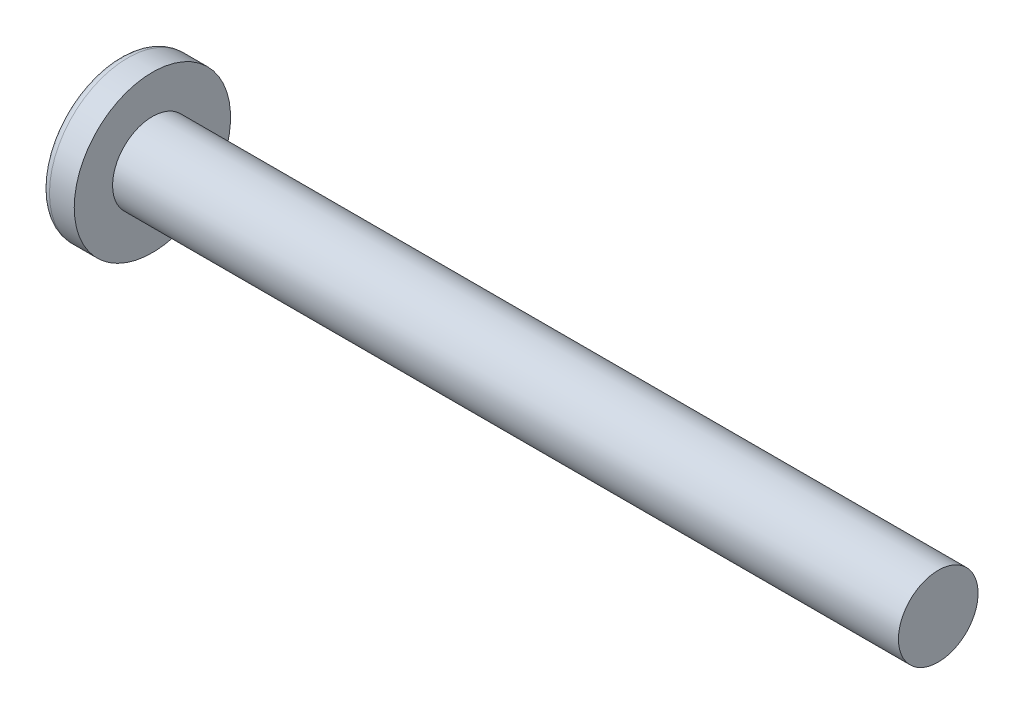
ISO-10303-21;
HEADER;
FILE_DESCRIPTION(('STEP AP214'),'2;1');
FILE_NAME('part.step','',(''),(''),'','','');
FILE_SCHEMA(('AUTOMOTIVE_DESIGN { 1 0 10303 214 1 1 1 1 }'));
ENDSEC;
DATA;
#1=APPLICATION_CONTEXT('core data for automotive mechanical design processes');
#2=APPLICATION_PROTOCOL_DEFINITION('international standard','automotive_design',2000,#1);
#3=PRODUCT_CONTEXT('',#1,'mechanical');
#4=PRODUCT('Part','Part','',(#3));
#5=PRODUCT_RELATED_PRODUCT_CATEGORY('part','',(#4));
#6=PRODUCT_DEFINITION_FORMATION('','',#4);
#7=PRODUCT_DEFINITION_CONTEXT('part definition',#1,'design');
#8=PRODUCT_DEFINITION('design','',#6,#7);
#9=PRODUCT_DEFINITION_SHAPE('','',#8);
#10=(LENGTH_UNIT() NAMED_UNIT(*) SI_UNIT(.MILLI.,.METRE.));
#11=(NAMED_UNIT(*) PLANE_ANGLE_UNIT() SI_UNIT($,.RADIAN.));
#12=(NAMED_UNIT(*) SI_UNIT($,.STERADIAN.) SOLID_ANGLE_UNIT());
#13=UNCERTAINTY_MEASURE_WITH_UNIT(LENGTH_MEASURE(1.E-05),#10,'distance_accuracy_value','');
#14=(GEOMETRIC_REPRESENTATION_CONTEXT(3) GLOBAL_UNCERTAINTY_ASSIGNED_CONTEXT((#13)) GLOBAL_UNIT_ASSIGNED_CONTEXT((#10,
#11,#12)) REPRESENTATION_CONTEXT('',''));
#15=CARTESIAN_POINT('',(0.,0.,0.));
#16=DIRECTION('',(0.,0.,1.));
#17=DIRECTION('',(1.,0.,0.));
#18=AXIS2_PLACEMENT_3D('',#15,#16,#17);
#19=CARTESIAN_POINT('',(7.7216,0.,0.));
#20=DIRECTION('',(-1.,0.,0.));
#21=DIRECTION('',(0.,1.,0.));
#22=AXIS2_PLACEMENT_3D('',#19,#20,#21);
#23=SPHERICAL_SURFACE('',#22,7.7216);
#24=CARTESIAN_POINT('',(1.46619704189251,0.,0.));
#25=DIRECTION('',(-1.,0.,0.));
#26=DIRECTION('',(0.,0.,1.));
#27=AXIS2_PLACEMENT_3D('',#24,#25,#26);
#28=CIRCLE('',#27,4.52692394366197);
#29=CARTESIAN_POINT('',(1.46619704189251,0.,4.52692394366197));
#30=VERTEX_POINT('',#29);
#31=EDGE_CURVE('E151',#30,#30,#28,.T.);
#32=ORIENTED_EDGE('',*,*,#31,.T.);
#33=EDGE_LOOP('',(#32));
#34=FACE_BOUND('',#33,.T.);
#35=CARTESIAN_POINT('',(7.71626836849415,-0.0635159579392897,0.));
#36=DIRECTION('',(-0.0836474251843073,-0.996495413065226,0.));
#37=DIRECTION('',(0.996495413065226,-0.0836474251843073,0.));
#38=AXIS2_PLACEMENT_3D('',#35,#36,#37);
#39=CIRCLE('',#38,7.72133692159541);
#40=CARTESIAN_POINT('',(0.492297297865043,0.542875774266794,2.65811491373462));
#41=VERTEX_POINT('',#40);
#42=CARTESIAN_POINT('',(0.0437691983649017,0.580525943202944,0.580525943202946));
#43=VERTEX_POINT('',#42);
#44=EDGE_CURVE('E182',#41,#43,#39,.T.);
#45=ORIENTED_EDGE('',*,*,#44,.F.);
#46=CARTESIAN_POINT('',(6.22874657717022,0.,-1.88498542790488));
#47=DIRECTION('',(0.620849497837049,0.,0.783929780679038));
#48=DIRECTION('',(0.783929780679038,0.,-0.620849497837049));
#49=AXIS2_PLACEMENT_3D('',#46,#47,#48);
#50=CIRCLE('',#49,7.33766482980326);
#51=CARTESIAN_POINT('',(0.492297297865043,-0.542875774266813,2.65811491373462));
#52=VERTEX_POINT('',#51);
#53=EDGE_CURVE('E147',#41,#52,#50,.T.);
#54=ORIENTED_EDGE('',*,*,#53,.T.);
#55=CARTESIAN_POINT('',(7.71626836849415,0.0635159579392895,0.));
#56=DIRECTION('',(-0.0836474251843072,0.996495413065226,0.));
#57=DIRECTION('',(-0.996495413065226,-0.0836474251843073,0.));
#58=AXIS2_PLACEMENT_3D('',#55,#56,#57);
#59=CIRCLE('',#58,7.72133692159541);
#60=CARTESIAN_POINT('',(0.0437691983649017,-0.580525943202948,0.580525943202946));
#61=VERTEX_POINT('',#60);
#62=EDGE_CURVE('E103',#61,#52,#59,.T.);
#63=ORIENTED_EDGE('',*,*,#62,.F.);
#64=CARTESIAN_POINT('',(7.71626836849415,0.,-0.0635159579392895));
#65=DIRECTION('',(-0.0836474251843072,0.,-0.996495413065226));
#66=DIRECTION('',(-0.996495413065226,0.,0.0836474251843073));
#67=AXIS2_PLACEMENT_3D('',#64,#65,#66);
#68=CIRCLE('',#67,7.72133692159541);
#69=CARTESIAN_POINT('',(0.492297297865042,-2.65811491373462,0.542875774266803));
#70=VERTEX_POINT('',#69);
#71=EDGE_CURVE('E128',#70,#61,#68,.T.);
#72=ORIENTED_EDGE('',*,*,#71,.F.);
#73=CARTESIAN_POINT('',(6.22874657717022,1.88498542790488,0.));
#74=DIRECTION('',(0.620849497837048,-0.783929780679038,0.));
#75=DIRECTION('',(0.783929780679038,0.620849497837048,0.));
#76=AXIS2_PLACEMENT_3D('',#73,#74,#75);
#77=CIRCLE('',#76,7.33766482980326);
#78=CARTESIAN_POINT('',(0.492297297865042,-2.65811491373462,-0.542875774266803));
#79=VERTEX_POINT('',#78);
#80=EDGE_CURVE('E136',#70,#79,#77,.T.);
#81=ORIENTED_EDGE('',*,*,#80,.T.);
#82=CARTESIAN_POINT('',(7.71626836849415,0.,0.0635159579392897));
#83=DIRECTION('',(-0.0836474251843073,0.,0.996495413065226));
#84=DIRECTION('',(0.996495413065226,0.,0.0836474251843073));
#85=AXIS2_PLACEMENT_3D('',#82,#83,#84);
#86=CIRCLE('',#85,7.72133692159541);
#87=CARTESIAN_POINT('',(0.0437691983649017,-0.580525943202944,-0.580525943202946));
#88=VERTEX_POINT('',#87);
#89=EDGE_CURVE('E46',#88,#79,#86,.T.);
#90=ORIENTED_EDGE('',*,*,#89,.F.);
#91=CARTESIAN_POINT('',(0.492297297865041,-0.542875774266793,-2.65811491373462));
#92=VERTEX_POINT('',#91);
#93=EDGE_CURVE('E189',#92,#88,#59,.T.);
#94=ORIENTED_EDGE('',*,*,#93,.F.);
#95=CARTESIAN_POINT('',(6.22874657717022,0.,1.88498542790488));
#96=DIRECTION('',(0.620849497837048,0.,-0.783929780679038));
#97=DIRECTION('',(-0.783929780679038,0.,-0.620849497837048));
#98=AXIS2_PLACEMENT_3D('',#95,#96,#97);
#99=CIRCLE('',#98,7.33766482980326);
#100=CARTESIAN_POINT('',(0.492297297865041,0.542875774266812,-2.65811491373462));
#101=VERTEX_POINT('',#100);
#102=EDGE_CURVE('E129',#92,#101,#99,.T.);
#103=ORIENTED_EDGE('',*,*,#102,.T.);
#104=CARTESIAN_POINT('',(0.0437691983649017,0.580525943202948,-0.580525943202946));
#105=VERTEX_POINT('',#104);
#106=EDGE_CURVE('E177',#105,#101,#39,.T.);
#107=ORIENTED_EDGE('',*,*,#106,.F.);
#108=CARTESIAN_POINT('',(0.492297297865042,2.65811491373462,-0.542875774266803));
#109=VERTEX_POINT('',#108);
#110=EDGE_CURVE('E39',#109,#105,#86,.T.);
#111=ORIENTED_EDGE('',*,*,#110,.F.);
#112=CARTESIAN_POINT('',(6.22874657717022,-1.88498542790488,0.));
#113=DIRECTION('',(0.620849497837049,0.783929780679038,0.));
#114=DIRECTION('',(-0.783929780679038,0.620849497837049,0.));
#115=AXIS2_PLACEMENT_3D('',#112,#113,#114);
#116=CIRCLE('',#115,7.33766482980326);
#117=CARTESIAN_POINT('',(0.492297297865043,2.65811491373462,0.542875774266803));
#118=VERTEX_POINT('',#117);
#119=EDGE_CURVE('E11',#109,#118,#116,.T.);
#120=ORIENTED_EDGE('',*,*,#119,.T.);
#121=EDGE_CURVE('E165',#43,#118,#68,.T.);
#122=ORIENTED_EDGE('',*,*,#121,.F.);
#123=EDGE_LOOP('',(#45,#54,#63,#72,#81,#90,#94,#103,#107,#111,#120,#122));
#124=FACE_BOUND('',#123,.T.);
#125=ADVANCED_FACE('F31',(#34,#124),#23,.T.);
#126=CARTESIAN_POINT('',(3.8486267281106,0.,-0.261140092165899));
#127=DIRECTION('',(-0.0836474251843073,0.,0.996495413065226));
#128=DIRECTION('',(0.996495413065226,0.,0.0836474251843073));
#129=AXIS2_PLACEMENT_3D('',#126,#127,#128);
#130=PLANE('',#129);
#131=ORIENTED_EDGE('',*,*,#110,.T.);
#132=DIRECTION('',(0.993027416127926,-0.0833563159523445,0.0833563159523442));
#133=VECTOR('',#132,1.);
#134=CARTESIAN_POINT('',(3.87024262719418,0.259325618885161,-0.25932561888516));
#135=LINE('',#134,#133);
#136=CARTESIAN_POINT('',(3.4798,0.292100000000001,-0.292099999999999));
#137=VERTEX_POINT('',#136);
#138=EDGE_CURVE('E171',#105,#137,#135,.T.);
#139=ORIENTED_EDGE('',*,*,#138,.T.);
#140=DIRECTION('',(0.782237983126563,-0.619509643571037,0.0656623124522297));
#141=VECTOR('',#140,1.);
#142=CARTESIAN_POINT('',(0.,3.048,-0.5842));
#143=LINE('',#142,#141);
#144=EDGE_CURVE('E152',#109,#137,#143,.T.);
#145=ORIENTED_EDGE('',*,*,#144,.F.);
#146=EDGE_LOOP('',(#131,#139,#145));
#147=FACE_BOUND('',#146,.T.);
#148=ADVANCED_FACE('F170',(#147),#130,.T.);
#149=DIRECTION('',(0.782237983126563,0.619509643571037,0.0656623124522297));
#150=VECTOR('',#149,1.);
#151=CARTESIAN_POINT('',(0.,-3.048,-0.5842));
#152=LINE('',#151,#150);
#153=CARTESIAN_POINT('',(3.4798,-0.2921,-0.2921));
#154=VERTEX_POINT('',#153);
#155=EDGE_CURVE('E137',#79,#154,#152,.T.);
#156=ORIENTED_EDGE('',*,*,#155,.T.);
#157=DIRECTION('',(-0.993027416127926,-0.0833563159523438,-0.0833563159523442));
#158=VECTOR('',#157,1.);
#159=CARTESIAN_POINT('',(3.87024262719418,-0.259325618885159,-0.25932561888516));
#160=LINE('',#159,#158);
#161=EDGE_CURVE('E192',#154,#88,#160,.T.);
#162=ORIENTED_EDGE('',*,*,#161,.T.);
#163=ORIENTED_EDGE('',*,*,#89,.T.);
#164=EDGE_LOOP('',(#156,#162,#163));
#165=FACE_BOUND('',#164,.T.);
#166=ADVANCED_FACE('F207',(#165),#130,.T.);
#167=CARTESIAN_POINT('',(3.8486267281106,0.,0.261140092165899));
#168=DIRECTION('',(-0.0836474251843072,0.,-0.996495413065226));
#169=DIRECTION('',(-0.996495413065226,0.,0.0836474251843073));
#170=AXIS2_PLACEMENT_3D('',#167,#168,#169);
#171=PLANE('',#170);
#172=DIRECTION('',(0.782237983126563,-0.619509643571037,-0.0656623124522298));
#173=VECTOR('',#172,1.);
#174=CARTESIAN_POINT('',(0.,3.048,0.5842));
#175=LINE('',#174,#173);
#176=CARTESIAN_POINT('',(3.4798,0.2921,0.2921));
#177=VERTEX_POINT('',#176);
#178=EDGE_CURVE('E208',#118,#177,#175,.T.);
#179=ORIENTED_EDGE('',*,*,#178,.T.);
#180=DIRECTION('',(-0.993027416127926,0.0833563159523439,0.0833563159523442));
#181=VECTOR('',#180,1.);
#182=CARTESIAN_POINT('',(3.87024262719418,0.259325618885159,0.25932561888516));
#183=LINE('',#182,#181);
#184=EDGE_CURVE('E186',#177,#43,#183,.T.);
#185=ORIENTED_EDGE('',*,*,#184,.T.);
#186=ORIENTED_EDGE('',*,*,#121,.T.);
#187=EDGE_LOOP('',(#179,#185,#186));
#188=FACE_BOUND('',#187,.T.);
#189=ADVANCED_FACE('F212',(#188),#171,.T.);
#190=ORIENTED_EDGE('',*,*,#71,.T.);
#191=DIRECTION('',(0.993027416127926,0.0833563159523445,-0.0833563159523441));
#192=VECTOR('',#191,1.);
#193=CARTESIAN_POINT('',(3.87024262719418,-0.259325618885161,0.25932561888516));
#194=LINE('',#193,#192);
#195=CARTESIAN_POINT('',(3.4798,-0.292100000000001,0.292099999999999));
#196=VERTEX_POINT('',#195);
#197=EDGE_CURVE('E101',#61,#196,#194,.T.);
#198=ORIENTED_EDGE('',*,*,#197,.T.);
#199=DIRECTION('',(0.782237983126563,0.619509643571037,-0.0656623124522296));
#200=VECTOR('',#199,1.);
#201=CARTESIAN_POINT('',(0.,-3.048,0.584199999999999));
#202=LINE('',#201,#200);
#203=EDGE_CURVE('E126',#70,#196,#202,.T.);
#204=ORIENTED_EDGE('',*,*,#203,.F.);
#205=EDGE_LOOP('',(#190,#198,#204));
#206=FACE_BOUND('',#205,.T.);
#207=ADVANCED_FACE('F125',(#206),#171,.T.);
#208=CARTESIAN_POINT('',(-25.4,0.,0.));
#209=DIRECTION('',(-1.,0.,0.));
#210=DIRECTION('',(0.,0.,1.));
#211=AXIS2_PLACEMENT_3D('',#208,#209,#210);
#212=CYLINDRICAL_SURFACE('',#211,2.413);
#213=CARTESIAN_POINT('',(51.0032,0.,0.));
#214=DIRECTION('',(-1.,0.,0.));
#215=DIRECTION('',(0.,0.,1.));
#216=AXIS2_PLACEMENT_3D('',#213,#214,#215);
#217=CIRCLE('',#216,2.413);
#218=CARTESIAN_POINT('',(51.0032,0.,2.413));
#219=VERTEX_POINT('',#218);
#220=EDGE_CURVE('E148',#219,#219,#217,.T.);
#221=ORIENTED_EDGE('',*,*,#220,.T.);
#222=EDGE_LOOP('',(#221));
#223=FACE_BOUND('',#222,.T.);
#224=CARTESIAN_POINT('',(3.3782,0.,0.));
#225=DIRECTION('',(-1.,0.,0.));
#226=DIRECTION('',(0.,0.,1.));
#227=AXIS2_PLACEMENT_3D('',#224,#225,#226);
#228=CIRCLE('',#227,2.413);
#229=CARTESIAN_POINT('',(3.3782,0.,2.413));
#230=VERTEX_POINT('',#229);
#231=EDGE_CURVE('E161',#230,#230,#228,.T.);
#232=ORIENTED_EDGE('',*,*,#231,.F.);
#233=EDGE_LOOP('',(#232));
#234=FACE_BOUND('',#233,.T.);
#235=ADVANCED_FACE('F33',(#223,#234),#212,.T.);
#236=CARTESIAN_POINT('',(3.3782,2.413,0.));
#237=DIRECTION('',(-1.,0.,0.));
#238=DIRECTION('',(0.,0.,1.));
#239=AXIS2_PLACEMENT_3D('',#236,#237,#238);
#240=PLANE('',#239);
#241=CARTESIAN_POINT('',(3.3782,0.,0.));
#242=DIRECTION('',(-1.,0.,0.));
#243=DIRECTION('',(0.,0.,1.));
#244=AXIS2_PLACEMENT_3D('',#241,#242,#243);
#245=CIRCLE('',#244,4.7371);
#246=CARTESIAN_POINT('',(3.3782,0.,4.7371));
#247=VERTEX_POINT('',#246);
#248=EDGE_CURVE('E158',#247,#247,#245,.T.);
#249=ORIENTED_EDGE('',*,*,#248,.F.);
#250=EDGE_LOOP('',(#249));
#251=FACE_BOUND('',#250,.T.);
#252=ORIENTED_EDGE('',*,*,#231,.T.);
#253=EDGE_LOOP('',(#252));
#254=FACE_BOUND('',#253,.T.);
#255=ADVANCED_FACE('F240',(#251,#254),#240,.F.);
#256=CARTESIAN_POINT('',(-25.4,0.,0.));
#257=DIRECTION('',(-1.,0.,0.));
#258=DIRECTION('',(0.,0.,1.));
#259=AXIS2_PLACEMENT_3D('',#256,#257,#258);
#260=CYLINDRICAL_SURFACE('',#259,4.7371);
#261=ORIENTED_EDGE('',*,*,#248,.T.);
#262=EDGE_LOOP('',(#261));
#263=FACE_BOUND('',#262,.T.);
#264=CARTESIAN_POINT('',(1.87773671018905,0.,0.));
#265=DIRECTION('',(-1.,0.,0.));
#266=DIRECTION('',(0.,0.,1.));
#267=AXIS2_PLACEMENT_3D('',#264,#265,#266);
#268=CIRCLE('',#267,4.7371);
#269=CARTESIAN_POINT('',(1.87773671018905,0.,4.7371));
#270=VERTEX_POINT('',#269);
#271=EDGE_CURVE('E155',#270,#270,#268,.T.);
#272=ORIENTED_EDGE('',*,*,#271,.F.);
#273=EDGE_LOOP('',(#272));
#274=FACE_BOUND('',#273,.T.);
#275=ADVANCED_FACE('F237',(#263,#274),#260,.T.);
#276=CARTESIAN_POINT('',(1.87773671018906,0.,0.));
#277=DIRECTION('',(-1.,0.,0.));
#278=DIRECTION('',(0.,0.,1.));
#279=AXIS2_PLACEMENT_3D('',#276,#277,#278);
#280=TOROIDAL_SURFACE('',#279,4.2291,0.508);
#281=ORIENTED_EDGE('',*,*,#271,.T.);
#282=EDGE_LOOP('',(#281));
#283=FACE_BOUND('',#282,.T.);
#284=ORIENTED_EDGE('',*,*,#31,.F.);
#285=EDGE_LOOP('',(#284));
#286=FACE_BOUND('',#285,.T.);
#287=ADVANCED_FACE('F234',(#283,#286),#280,.T.);
#288=CARTESIAN_POINT('',(51.0032,2.413,0.));
#289=DIRECTION('',(1.,0.,0.));
#290=DIRECTION('',(0.,0.,-1.));
#291=AXIS2_PLACEMENT_3D('',#288,#289,#290);
#292=PLANE('',#291);
#293=ORIENTED_EDGE('',*,*,#220,.F.);
#294=EDGE_LOOP('',(#293));
#295=FACE_BOUND('',#294,.T.);
#296=ADVANCED_FACE('F232',(#295),#292,.T.);
#297=CARTESIAN_POINT('',(0.,3.048,0.5842));
#298=DIRECTION('',(0.620849497837049,0.783929780679038,0.));
#299=DIRECTION('',(-0.783929780679038,0.620849497837049,0.));
#300=AXIS2_PLACEMENT_3D('',#297,#298,#299);
#301=PLANE('',#300);
#302=ORIENTED_EDGE('',*,*,#144,.T.);
#303=DIRECTION('',(0.,0.,-1.));
#304=VECTOR('',#303,1.);
#305=CARTESIAN_POINT('',(3.4798,0.2921,0.2921));
#306=LINE('',#305,#304);
#307=EDGE_CURVE('E119',#177,#137,#306,.T.);
#308=ORIENTED_EDGE('',*,*,#307,.F.);
#309=ORIENTED_EDGE('',*,*,#178,.F.);
#310=ORIENTED_EDGE('',*,*,#119,.F.);
#311=EDGE_LOOP('',(#302,#308,#309,#310));
#312=FACE_BOUND('',#311,.T.);
#313=ADVANCED_FACE('F211',(#312),#301,.F.);
#314=CARTESIAN_POINT('',(3.4798,-0.2921,-0.2921));
#315=DIRECTION('',(0.620849497837048,-0.783929780679038,0.));
#316=DIRECTION('',(0.783929780679038,0.620849497837048,0.));
#317=AXIS2_PLACEMENT_3D('',#314,#315,#316);
#318=PLANE('',#317);
#319=ORIENTED_EDGE('',*,*,#203,.T.);
#320=DIRECTION('',(0.,0.,1.));
#321=VECTOR('',#320,1.);
#322=CARTESIAN_POINT('',(3.4798,-0.2921,-0.2921));
#323=LINE('',#322,#321);
#324=EDGE_CURVE('E118',#154,#196,#323,.T.);
#325=ORIENTED_EDGE('',*,*,#324,.F.);
#326=ORIENTED_EDGE('',*,*,#155,.F.);
#327=ORIENTED_EDGE('',*,*,#80,.F.);
#328=EDGE_LOOP('',(#319,#325,#326,#327));
#329=FACE_BOUND('',#328,.T.);
#330=ADVANCED_FACE('F133',(#329),#318,.F.);
#331=CARTESIAN_POINT('',(3.4798,0.2921,-0.2921));
#332=DIRECTION('',(-1.,0.,0.));
#333=DIRECTION('',(0.,0.,1.));
#334=AXIS2_PLACEMENT_3D('',#331,#332,#333);
#335=PLANE('',#334);
#336=DIRECTION('',(0.,1.,0.));
#337=VECTOR('',#336,1.);
#338=CARTESIAN_POINT('',(3.4798,-0.2921,-0.2921));
#339=LINE('',#338,#337);
#340=EDGE_CURVE('E141',#154,#137,#339,.T.);
#341=ORIENTED_EDGE('',*,*,#340,.F.);
#342=ORIENTED_EDGE('',*,*,#324,.T.);
#343=DIRECTION('',(0.,-1.,0.));
#344=VECTOR('',#343,1.);
#345=CARTESIAN_POINT('',(3.4798,0.2921,0.2921));
#346=LINE('',#345,#344);
#347=EDGE_CURVE('E110',#177,#196,#346,.T.);
#348=ORIENTED_EDGE('',*,*,#347,.F.);
#349=ORIENTED_EDGE('',*,*,#307,.T.);
#350=EDGE_LOOP('',(#341,#342,#348,#349));
#351=FACE_BOUND('',#350,.T.);
#352=ADVANCED_FACE('F139',(#351),#335,.T.);
#353=CARTESIAN_POINT('',(3.4798,0.292100000000001,-0.292099999999999));
#354=DIRECTION('',(0.620849497837048,0.,-0.783929780679038));
#355=DIRECTION('',(0.783929780679038,0.,0.620849497837048));
#356=AXIS2_PLACEMENT_3D('',#353,#354,#355);
#357=PLANE('',#356);
#358=DIRECTION('',(0.782237983126563,0.0656623124522275,0.619509643571037));
#359=VECTOR('',#358,1.);
#360=CARTESIAN_POINT('',(0.,-0.584199999999989,-3.048));
#361=LINE('',#360,#359);
#362=EDGE_CURVE('E197',#92,#154,#361,.T.);
#363=ORIENTED_EDGE('',*,*,#362,.T.);
#364=ORIENTED_EDGE('',*,*,#340,.T.);
#365=DIRECTION('',(0.782237983126563,-0.0656623124522319,0.619509643571037));
#366=VECTOR('',#365,1.);
#367=CARTESIAN_POINT('',(0.,0.584200000000011,-3.048));
#368=LINE('',#367,#366);
#369=EDGE_CURVE('E107',#101,#137,#368,.T.);
#370=ORIENTED_EDGE('',*,*,#369,.F.);
#371=ORIENTED_EDGE('',*,*,#102,.F.);
#372=EDGE_LOOP('',(#363,#364,#370,#371));
#373=FACE_BOUND('',#372,.T.);
#374=ADVANCED_FACE('F202',(#373),#357,.F.);
#375=CARTESIAN_POINT('',(3.8486267281106,-0.261140092165899,0.));
#376=DIRECTION('',(-0.0836474251843072,0.996495413065226,0.));
#377=DIRECTION('',(-0.996495413065226,-0.0836474251843073,0.));
#378=AXIS2_PLACEMENT_3D('',#375,#376,#377);
#379=PLANE('',#378);
#380=ORIENTED_EDGE('',*,*,#93,.T.);
#381=ORIENTED_EDGE('',*,*,#161,.F.);
#382=ORIENTED_EDGE('',*,*,#362,.F.);
#383=EDGE_LOOP('',(#380,#381,#382));
#384=FACE_BOUND('',#383,.T.);
#385=ADVANCED_FACE('F206',(#384),#379,.T.);
#386=CARTESIAN_POINT('',(3.8486267281106,0.261140092165899,0.));
#387=DIRECTION('',(-0.0836474251843073,-0.996495413065226,0.));
#388=DIRECTION('',(0.996495413065226,-0.0836474251843073,0.));
#389=AXIS2_PLACEMENT_3D('',#386,#387,#388);
#390=PLANE('',#389);
#391=ORIENTED_EDGE('',*,*,#106,.T.);
#392=ORIENTED_EDGE('',*,*,#369,.T.);
#393=ORIENTED_EDGE('',*,*,#138,.F.);
#394=EDGE_LOOP('',(#391,#392,#393));
#395=FACE_BOUND('',#394,.T.);
#396=ADVANCED_FACE('F200',(#395),#390,.T.);
#397=CARTESIAN_POINT('',(0.,-0.584200000000011,3.048));
#398=DIRECTION('',(0.620849497837049,0.,0.783929780679038));
#399=DIRECTION('',(-0.783929780679038,0.,0.620849497837049));
#400=AXIS2_PLACEMENT_3D('',#397,#398,#399);
#401=PLANE('',#400);
#402=DIRECTION('',(0.782237983126563,-0.0656623124522275,-0.619509643571037));
#403=VECTOR('',#402,1.);
#404=CARTESIAN_POINT('',(0.,0.584199999999989,3.048));
#405=LINE('',#404,#403);
#406=EDGE_CURVE('E106',#41,#177,#405,.T.);
#407=ORIENTED_EDGE('',*,*,#406,.T.);
#408=ORIENTED_EDGE('',*,*,#347,.T.);
#409=DIRECTION('',(0.782237983126563,0.0656623124522319,-0.619509643571037));
#410=VECTOR('',#409,1.);
#411=CARTESIAN_POINT('',(0.,-0.584200000000011,3.048));
#412=LINE('',#411,#410);
#413=EDGE_CURVE('E97',#52,#196,#412,.T.);
#414=ORIENTED_EDGE('',*,*,#413,.F.);
#415=ORIENTED_EDGE('',*,*,#53,.F.);
#416=EDGE_LOOP('',(#407,#408,#414,#415));
#417=FACE_BOUND('',#416,.T.);
#418=ADVANCED_FACE('F111',(#417),#401,.F.);
#419=ORIENTED_EDGE('',*,*,#44,.T.);
#420=ORIENTED_EDGE('',*,*,#184,.F.);
#421=ORIENTED_EDGE('',*,*,#406,.F.);
#422=EDGE_LOOP('',(#419,#420,#421));
#423=FACE_BOUND('',#422,.T.);
#424=ADVANCED_FACE('F213',(#423),#390,.T.);
#425=ORIENTED_EDGE('',*,*,#62,.T.);
#426=ORIENTED_EDGE('',*,*,#413,.T.);
#427=ORIENTED_EDGE('',*,*,#197,.F.);
#428=EDGE_LOOP('',(#425,#426,#427));
#429=FACE_BOUND('',#428,.T.);
#430=ADVANCED_FACE('F99',(#429),#379,.T.);
#431=CLOSED_SHELL('',(#125,#148,#166,#189,#207,#235,#255,#275,#287,#296,#313,#330,#352,#374,
#385,#396,#418,#424,#430));
#432=MANIFOLD_SOLID_BREP('B2',#431);
#433=ADVANCED_BREP_SHAPE_REPRESENTATION('',(#18,#432),#14);
#434=SHAPE_DEFINITION_REPRESENTATION(#9,#433);
ENDSEC;
END-ISO-10303-21;
